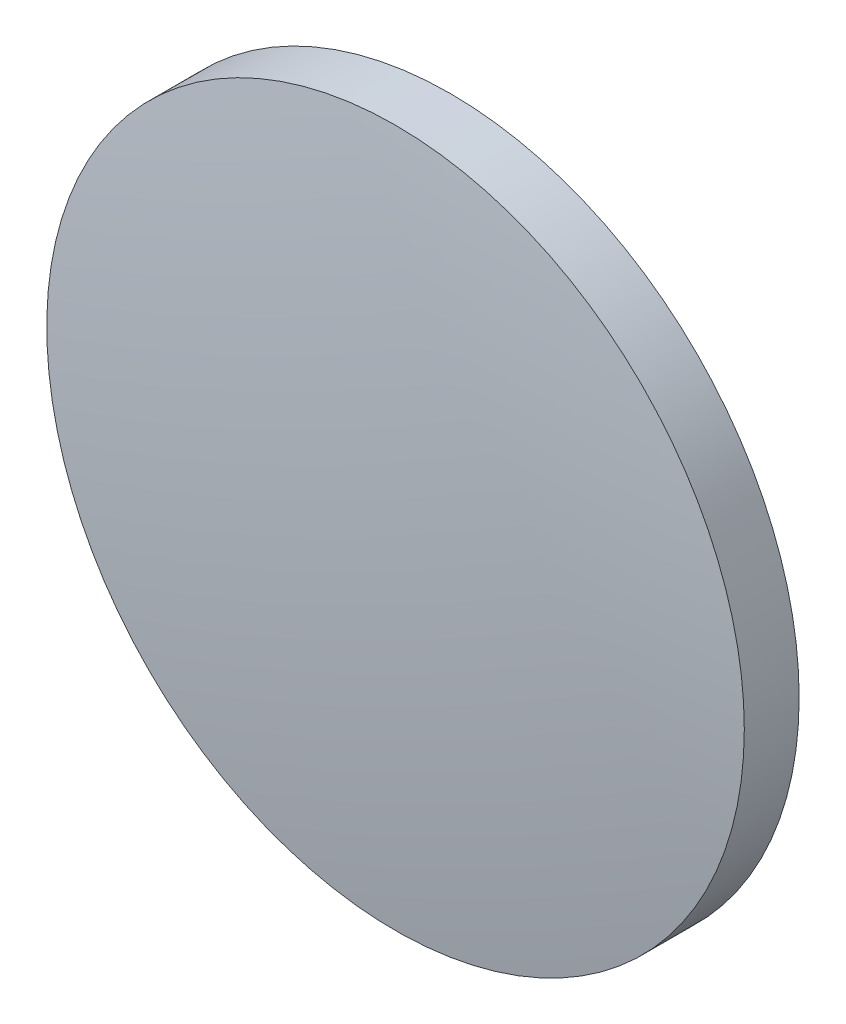
ISO-10303-21;
HEADER;
FILE_DESCRIPTION(('STEP AP214'),'2;1');
FILE_NAME('part.step','',(''),(''),'','','');
FILE_SCHEMA(('AUTOMOTIVE_DESIGN { 1 0 10303 214 1 1 1 1 }'));
ENDSEC;
DATA;
#1=APPLICATION_CONTEXT('core data for automotive mechanical design processes');
#2=APPLICATION_PROTOCOL_DEFINITION('international standard','automotive_design',2000,#1);
#3=PRODUCT_CONTEXT('',#1,'mechanical');
#4=PRODUCT('Part','Part','',(#3));
#5=PRODUCT_RELATED_PRODUCT_CATEGORY('part','',(#4));
#6=PRODUCT_DEFINITION_FORMATION('','',#4);
#7=PRODUCT_DEFINITION_CONTEXT('part definition',#1,'design');
#8=PRODUCT_DEFINITION('design','',#6,#7);
#9=PRODUCT_DEFINITION_SHAPE('','',#8);
#10=(LENGTH_UNIT() NAMED_UNIT(*) SI_UNIT(.MILLI.,.METRE.));
#11=(NAMED_UNIT(*) PLANE_ANGLE_UNIT() SI_UNIT($,.RADIAN.));
#12=(NAMED_UNIT(*) SI_UNIT($,.STERADIAN.) SOLID_ANGLE_UNIT());
#13=UNCERTAINTY_MEASURE_WITH_UNIT(LENGTH_MEASURE(1.E-05),#10,'distance_accuracy_value','');
#14=(GEOMETRIC_REPRESENTATION_CONTEXT(3) GLOBAL_UNCERTAINTY_ASSIGNED_CONTEXT((#13)) GLOBAL_UNIT_ASSIGNED_CONTEXT((#10,
#11,#12)) REPRESENTATION_CONTEXT('',''));
#15=CARTESIAN_POINT('',(0.,0.,0.));
#16=DIRECTION('',(0.,0.,1.));
#17=DIRECTION('',(1.,0.,0.));
#18=AXIS2_PLACEMENT_3D('',#15,#16,#17);
#19=CARTESIAN_POINT('',(0.,0.,-99.4900204918018));
#20=DIRECTION('',(0.,0.,1.));
#21=DIRECTION('',(0.,1.,0.));
#22=AXIS2_PLACEMENT_3D('',#19,#20,#21);
#23=SPHERICAL_SURFACE('',#22,100.89);
#24=CARTESIAN_POINT('',(0.,0.,0.597451751231668));
#25=DIRECTION('',(0.,0.,1.));
#26=DIRECTION('',(1.,0.,0.));
#27=AXIS2_PLACEMENT_3D('',#24,#25,#26);
#28=CIRCLE('',#27,12.7);
#29=CARTESIAN_POINT('',(12.7,0.,0.597451751231668));
#30=VERTEX_POINT('',#29);
#31=EDGE_CURVE('E8',#30,#30,#28,.T.);
#32=ORIENTED_EDGE('',*,*,#31,.T.);
#33=EDGE_LOOP('',(#32));
#34=FACE_BOUND('',#33,.T.);
#35=ADVANCED_FACE('F12',(#34),#23,.T.);
#36=CARTESIAN_POINT('',(0.,0.,9.04508326303924));
#37=DIRECTION('',(0.,0.,1.));
#38=DIRECTION('',(1.,0.,0.));
#39=AXIS2_PLACEMENT_3D('',#36,#37,#38);
#40=CYLINDRICAL_SURFACE('',#39,12.7);
#41=ORIENTED_EDGE('',*,*,#31,.F.);
#42=EDGE_LOOP('',(#41));
#43=FACE_BOUND('',#42,.T.);
#44=CARTESIAN_POINT('',(0.,0.,-1.39997950819818));
#45=DIRECTION('',(0.,0.,1.));
#46=DIRECTION('',(1.,0.,0.));
#47=AXIS2_PLACEMENT_3D('',#44,#45,#46);
#48=CIRCLE('',#47,12.7);
#49=CARTESIAN_POINT('',(12.7,0.,-1.39997950819818));
#50=VERTEX_POINT('',#49);
#51=EDGE_CURVE('E18',#50,#50,#48,.T.);
#52=ORIENTED_EDGE('',*,*,#51,.T.);
#53=EDGE_LOOP('',(#52));
#54=FACE_BOUND('',#53,.T.);
#55=ADVANCED_FACE('F24',(#43,#54),#40,.T.);
#56=CARTESIAN_POINT('',(0.,0.,-289.320020491802));
#57=DIRECTION('',(0.,0.,1.));
#58=DIRECTION('',(0.,1.,0.));
#59=AXIS2_PLACEMENT_3D('',#56,#57,#58);
#60=SPHERICAL_SURFACE('',#59,288.2);
#61=ORIENTED_EDGE('',*,*,#51,.F.);
#62=EDGE_LOOP('',(#61));
#63=FACE_BOUND('',#62,.T.);
#64=ADVANCED_FACE('F26',(#63),#60,.F.);
#65=CLOSED_SHELL('',(#35,#55,#64));
#66=MANIFOLD_SOLID_BREP('B1',#65);
#67=ADVANCED_BREP_SHAPE_REPRESENTATION('',(#18,#66),#14);
#68=SHAPE_DEFINITION_REPRESENTATION(#9,#67);
ENDSEC;
END-ISO-10303-21;
